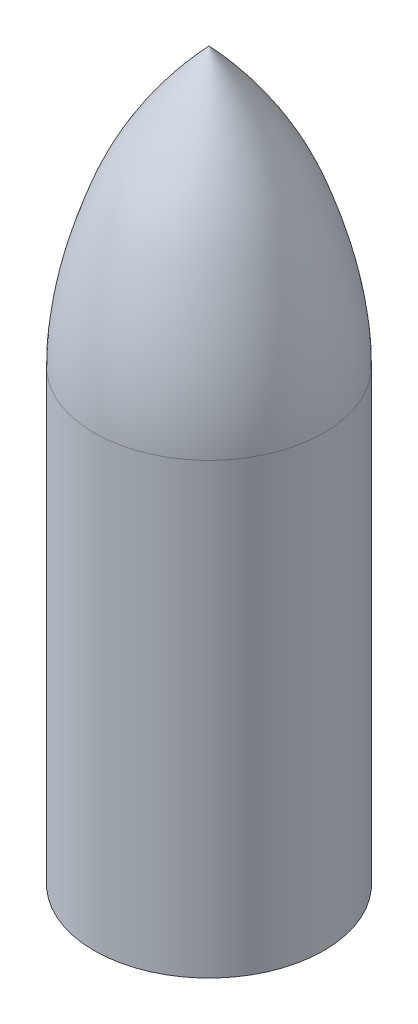
ISO-10303-21;
HEADER;
FILE_DESCRIPTION(('STEP AP214'),'2;1');
FILE_NAME('part.step','',(''),(''),'','','');
FILE_SCHEMA(('AUTOMOTIVE_DESIGN { 1 0 10303 214 1 1 1 1 }'));
ENDSEC;
DATA;
#1=APPLICATION_CONTEXT('core data for automotive mechanical design processes');
#2=APPLICATION_PROTOCOL_DEFINITION('international standard','automotive_design',2000,#1);
#3=PRODUCT_CONTEXT('',#1,'mechanical');
#4=PRODUCT('Part','Part','',(#3));
#5=PRODUCT_RELATED_PRODUCT_CATEGORY('part','',(#4));
#6=PRODUCT_DEFINITION_FORMATION('','',#4);
#7=PRODUCT_DEFINITION_CONTEXT('part definition',#1,'design');
#8=PRODUCT_DEFINITION('design','',#6,#7);
#9=PRODUCT_DEFINITION_SHAPE('','',#8);
#10=(LENGTH_UNIT() NAMED_UNIT(*) SI_UNIT(.MILLI.,.METRE.));
#11=(NAMED_UNIT(*) PLANE_ANGLE_UNIT() SI_UNIT($,.RADIAN.));
#12=(NAMED_UNIT(*) SI_UNIT($,.STERADIAN.) SOLID_ANGLE_UNIT());
#13=UNCERTAINTY_MEASURE_WITH_UNIT(LENGTH_MEASURE(1.E-05),#10,'distance_accuracy_value','');
#14=(GEOMETRIC_REPRESENTATION_CONTEXT(3) GLOBAL_UNCERTAINTY_ASSIGNED_CONTEXT((#13)) GLOBAL_UNIT_ASSIGNED_CONTEXT((#10,
#11,#12)) REPRESENTATION_CONTEXT('',''));
#15=CARTESIAN_POINT('',(0.,0.,0.));
#16=DIRECTION('',(0.,0.,1.));
#17=DIRECTION('',(1.,0.,0.));
#18=AXIS2_PLACEMENT_3D('',#15,#16,#17);
#19=CARTESIAN_POINT('',(0.,-160.,9.17105263157896));
#20=DIRECTION('',(0.,0.,1.));
#21=DIRECTION('',(1.,0.,0.));
#22=AXIS2_PLACEMENT_3D('',#19,#20,#21);
#23=PLANE('',#22);
#24=DIRECTION('',(1.,0.,0.));
#25=VECTOR('',#24,1.);
#26=CARTESIAN_POINT('',(0.,0.,9.17105263157896));
#27=LINE('',#26,#25);
#28=CARTESIAN_POINT('',(-36.9739850146078,0.,9.17105263157896));
#29=VERTEX_POINT('',#28);
#30=CARTESIAN_POINT('',(-25.3947197981944,0.,9.17105263157896));
#31=VERTEX_POINT('',#30);
#32=EDGE_CURVE('E153',#29,#31,#27,.T.);
#33=ORIENTED_EDGE('',*,*,#32,.T.);
#34=DIRECTION('',(0.,1.,0.));
#35=VECTOR('',#34,1.);
#36=CARTESIAN_POINT('',(-25.3947197981944,-160.,9.17105263157896));
#37=LINE('',#36,#35);
#38=CARTESIAN_POINT('',(-25.3947197981944,-160.,9.17105263157896));
#39=VERTEX_POINT('',#38);
#40=EDGE_CURVE('E11',#39,#31,#37,.T.);
#41=ORIENTED_EDGE('',*,*,#40,.F.);
#42=DIRECTION('',(1.,0.,0.));
#43=VECTOR('',#42,1.);
#44=CARTESIAN_POINT('',(0.,-160.,9.17105263157896));
#45=LINE('',#44,#43);
#46=CARTESIAN_POINT('',(-36.9739850146078,-160.,9.17105263157896));
#47=VERTEX_POINT('',#46);
#48=EDGE_CURVE('E110',#47,#39,#45,.T.);
#49=ORIENTED_EDGE('',*,*,#48,.F.);
#50=DIRECTION('',(0.,1.,0.));
#51=VECTOR('',#50,1.);
#52=CARTESIAN_POINT('',(-36.9739850146078,-160.,9.17105263157896));
#53=LINE('',#52,#51);
#54=EDGE_CURVE('E41',#47,#29,#53,.T.);
#55=ORIENTED_EDGE('',*,*,#54,.T.);
#56=EDGE_LOOP('',(#33,#41,#49,#55));
#57=FACE_BOUND('',#56,.T.);
#58=ADVANCED_FACE('F37',(#57),#23,.F.);
#59=CARTESIAN_POINT('',(0.,-160.,0.));
#60=DIRECTION('',(0.,1.,0.));
#61=DIRECTION('',(0.,0.,1.));
#62=AXIS2_PLACEMENT_3D('',#59,#60,#61);
#63=CYLINDRICAL_SURFACE('',#62,27.);
#64=CARTESIAN_POINT('',(0.,0.,0.));
#65=DIRECTION('',(0.,1.,0.));
#66=DIRECTION('',(0.,0.,1.));
#67=AXIS2_PLACEMENT_3D('',#64,#65,#66);
#68=CIRCLE('',#67,27.);
#69=CARTESIAN_POINT('',(25.3947197981944,0.,9.17105263157896));
#70=VERTEX_POINT('',#69);
#71=EDGE_CURVE('E111',#31,#70,#68,.T.);
#72=ORIENTED_EDGE('',*,*,#71,.T.);
#73=DIRECTION('',(0.,1.,0.));
#74=VECTOR('',#73,1.);
#75=CARTESIAN_POINT('',(25.3947197981944,-160.,9.17105263157896));
#76=LINE('',#75,#74);
#77=CARTESIAN_POINT('',(25.3947197981944,-160.,9.17105263157896));
#78=VERTEX_POINT('',#77);
#79=EDGE_CURVE('E47',#78,#70,#76,.T.);
#80=ORIENTED_EDGE('',*,*,#79,.F.);
#81=CARTESIAN_POINT('',(0.,-160.,0.));
#82=DIRECTION('',(0.,1.,0.));
#83=DIRECTION('',(0.,0.,1.));
#84=AXIS2_PLACEMENT_3D('',#81,#82,#83);
#85=CIRCLE('',#84,27.);
#86=EDGE_CURVE('E54',#39,#78,#85,.T.);
#87=ORIENTED_EDGE('',*,*,#86,.F.);
#88=ORIENTED_EDGE('',*,*,#40,.T.);
#89=EDGE_LOOP('',(#72,#80,#87,#88));
#90=FACE_BOUND('',#89,.T.);
#91=ADVANCED_FACE('F182',(#90),#63,.F.);
#92=CARTESIAN_POINT('',(37.0260149853922,0.,9.17105263157896));
#93=VERTEX_POINT('',#92);
#94=EDGE_CURVE('E117',#70,#93,#27,.T.);
#95=ORIENTED_EDGE('',*,*,#94,.T.);
#96=DIRECTION('',(0.,1.,0.));
#97=VECTOR('',#96,1.);
#98=CARTESIAN_POINT('',(37.0260149853922,-160.,9.17105263157896));
#99=LINE('',#98,#97);
#100=CARTESIAN_POINT('',(37.0260149853922,-160.,9.17105263157896));
#101=VERTEX_POINT('',#100);
#102=EDGE_CURVE('E123',#101,#93,#99,.T.);
#103=ORIENTED_EDGE('',*,*,#102,.F.);
#104=EDGE_CURVE('E115',#78,#101,#45,.T.);
#105=ORIENTED_EDGE('',*,*,#104,.F.);
#106=ORIENTED_EDGE('',*,*,#79,.T.);
#107=EDGE_LOOP('',(#95,#103,#105,#106));
#108=FACE_BOUND('',#107,.T.);
#109=ADVANCED_FACE('F181',(#108),#23,.F.);
#110=CARTESIAN_POINT('',(37.0260149853922,-160.,0.));
#111=DIRECTION('',(-1.,0.,0.));
#112=DIRECTION('',(0.,0.,1.));
#113=AXIS2_PLACEMENT_3D('',#110,#111,#112);
#114=PLANE('',#113);
#115=DIRECTION('',(0.,0.,1.));
#116=VECTOR('',#115,1.);
#117=CARTESIAN_POINT('',(37.0260149853922,0.,0.));
#118=LINE('',#117,#116);
#119=CARTESIAN_POINT('',(37.0260149853922,0.,-9.17105263157896));
#120=VERTEX_POINT('',#119);
#121=EDGE_CURVE('E162',#120,#93,#118,.T.);
#122=ORIENTED_EDGE('',*,*,#121,.F.);
#123=DIRECTION('',(0.,1.,0.));
#124=VECTOR('',#123,1.);
#125=CARTESIAN_POINT('',(37.0260149853922,-160.,-9.17105263157896));
#126=LINE('',#125,#124);
#127=CARTESIAN_POINT('',(37.0260149853922,-160.,-9.17105263157896));
#128=VERTEX_POINT('',#127);
#129=EDGE_CURVE('E126',#128,#120,#126,.T.);
#130=ORIENTED_EDGE('',*,*,#129,.F.);
#131=DIRECTION('',(0.,0.,1.));
#132=VECTOR('',#131,1.);
#133=CARTESIAN_POINT('',(37.0260149853922,-160.,0.));
#134=LINE('',#133,#132);
#135=EDGE_CURVE('E178',#128,#101,#134,.T.);
#136=ORIENTED_EDGE('',*,*,#135,.T.);
#137=ORIENTED_EDGE('',*,*,#102,.T.);
#138=EDGE_LOOP('',(#122,#130,#136,#137));
#139=FACE_BOUND('',#138,.T.);
#140=ADVANCED_FACE('F176',(#139),#114,.T.);
#141=CARTESIAN_POINT('',(0.,-160.,-9.17105263157896));
#142=DIRECTION('',(0.,0.,1.));
#143=DIRECTION('',(1.,0.,0.));
#144=AXIS2_PLACEMENT_3D('',#141,#142,#143);
#145=PLANE('',#144);
#146=DIRECTION('',(1.,0.,0.));
#147=VECTOR('',#146,1.);
#148=CARTESIAN_POINT('',(0.,0.,-9.17105263157896));
#149=LINE('',#148,#147);
#150=CARTESIAN_POINT('',(25.3947197981944,0.,-9.17105263157896));
#151=VERTEX_POINT('',#150);
#152=EDGE_CURVE('E160',#151,#120,#149,.T.);
#153=ORIENTED_EDGE('',*,*,#152,.F.);
#154=DIRECTION('',(0.,1.,0.));
#155=VECTOR('',#154,1.);
#156=CARTESIAN_POINT('',(25.3947197981944,-160.,-9.17105263157896));
#157=LINE('',#156,#155);
#158=CARTESIAN_POINT('',(25.3947197981944,-160.,-9.17105263157896));
#159=VERTEX_POINT('',#158);
#160=EDGE_CURVE('E129',#159,#151,#157,.T.);
#161=ORIENTED_EDGE('',*,*,#160,.F.);
#162=DIRECTION('',(1.,0.,0.));
#163=VECTOR('',#162,1.);
#164=CARTESIAN_POINT('',(0.,-160.,-9.17105263157896));
#165=LINE('',#164,#163);
#166=EDGE_CURVE('E172',#159,#128,#165,.T.);
#167=ORIENTED_EDGE('',*,*,#166,.T.);
#168=ORIENTED_EDGE('',*,*,#129,.T.);
#169=EDGE_LOOP('',(#153,#161,#167,#168));
#170=FACE_BOUND('',#169,.T.);
#171=ADVANCED_FACE('F170',(#170),#145,.T.);
#172=CARTESIAN_POINT('',(0.,-160.,0.));
#173=DIRECTION('',(0.,1.,0.));
#174=DIRECTION('',(0.,0.,1.));
#175=AXIS2_PLACEMENT_3D('',#172,#173,#174);
#176=CYLINDRICAL_SURFACE('',#175,27.);
#177=CARTESIAN_POINT('',(0.,0.,0.));
#178=DIRECTION('',(0.,1.,0.));
#179=DIRECTION('',(0.,0.,1.));
#180=AXIS2_PLACEMENT_3D('',#177,#178,#179);
#181=CIRCLE('',#180,27.);
#182=CARTESIAN_POINT('',(-25.3947197981944,0.,-9.17105263157896));
#183=VERTEX_POINT('',#182);
#184=EDGE_CURVE('E159',#151,#183,#181,.T.);
#185=ORIENTED_EDGE('',*,*,#184,.T.);
#186=DIRECTION('',(0.,1.,0.));
#187=VECTOR('',#186,1.);
#188=CARTESIAN_POINT('',(-25.3947197981944,-160.,-9.17105263157896));
#189=LINE('',#188,#187);
#190=CARTESIAN_POINT('',(-25.3947197981944,-160.,-9.17105263157896));
#191=VERTEX_POINT('',#190);
#192=EDGE_CURVE('E132',#191,#183,#189,.T.);
#193=ORIENTED_EDGE('',*,*,#192,.F.);
#194=CARTESIAN_POINT('',(0.,-160.,0.));
#195=DIRECTION('',(0.,1.,0.));
#196=DIRECTION('',(0.,0.,1.));
#197=AXIS2_PLACEMENT_3D('',#194,#195,#196);
#198=CIRCLE('',#197,27.);
#199=EDGE_CURVE('E190',#159,#191,#198,.T.);
#200=ORIENTED_EDGE('',*,*,#199,.F.);
#201=ORIENTED_EDGE('',*,*,#160,.T.);
#202=EDGE_LOOP('',(#185,#193,#200,#201));
#203=FACE_BOUND('',#202,.T.);
#204=ADVANCED_FACE('F197',(#203),#176,.F.);
#205=CARTESIAN_POINT('',(-36.9739850146078,0.,-9.17105263157896));
#206=VERTEX_POINT('',#205);
#207=EDGE_CURVE('E157',#206,#183,#149,.T.);
#208=ORIENTED_EDGE('',*,*,#207,.F.);
#209=DIRECTION('',(0.,1.,0.));
#210=VECTOR('',#209,1.);
#211=CARTESIAN_POINT('',(-36.9739850146078,-160.,-9.17105263157896));
#212=LINE('',#211,#210);
#213=CARTESIAN_POINT('',(-36.9739850146078,-160.,-9.17105263157896));
#214=VERTEX_POINT('',#213);
#215=EDGE_CURVE('E134',#214,#206,#212,.T.);
#216=ORIENTED_EDGE('',*,*,#215,.F.);
#217=EDGE_CURVE('E188',#214,#191,#165,.T.);
#218=ORIENTED_EDGE('',*,*,#217,.T.);
#219=ORIENTED_EDGE('',*,*,#192,.T.);
#220=EDGE_LOOP('',(#208,#216,#218,#219));
#221=FACE_BOUND('',#220,.T.);
#222=ADVANCED_FACE('F199',(#221),#145,.T.);
#223=CARTESIAN_POINT('',(-36.9739850146078,-160.,0.));
#224=DIRECTION('',(-1.,0.,0.));
#225=DIRECTION('',(0.,0.,1.));
#226=AXIS2_PLACEMENT_3D('',#223,#224,#225);
#227=PLANE('',#226);
#228=DIRECTION('',(0.,0.,1.));
#229=VECTOR('',#228,1.);
#230=CARTESIAN_POINT('',(-36.9739850146078,0.,0.));
#231=LINE('',#230,#229);
#232=EDGE_CURVE('E155',#206,#29,#231,.T.);
#233=ORIENTED_EDGE('',*,*,#232,.T.);
#234=ORIENTED_EDGE('',*,*,#54,.F.);
#235=DIRECTION('',(0.,0.,1.));
#236=VECTOR('',#235,1.);
#237=CARTESIAN_POINT('',(-36.9739850146078,-160.,0.));
#238=LINE('',#237,#236);
#239=EDGE_CURVE('E113',#214,#47,#238,.T.);
#240=ORIENTED_EDGE('',*,*,#239,.F.);
#241=ORIENTED_EDGE('',*,*,#215,.T.);
#242=EDGE_LOOP('',(#233,#234,#240,#241));
#243=FACE_BOUND('',#242,.T.);
#244=ADVANCED_FACE('F39',(#243),#227,.F.);
#245=CARTESIAN_POINT('',(0.,-160.,0.));
#246=DIRECTION('',(0.,1.,0.));
#247=DIRECTION('',(0.,0.,1.));
#248=AXIS2_PLACEMENT_3D('',#245,#246,#247);
#249=CYLINDRICAL_SURFACE('',#248,41.);
#250=CARTESIAN_POINT('',(0.,-160.,0.));
#251=DIRECTION('',(0.,1.,0.));
#252=DIRECTION('',(0.,0.,1.));
#253=AXIS2_PLACEMENT_3D('',#250,#251,#252);
#254=CIRCLE('',#253,41.);
#255=CARTESIAN_POINT('',(0.,-160.,41.));
#256=VERTEX_POINT('',#255);
#257=EDGE_CURVE('E141',#256,#256,#254,.T.);
#258=ORIENTED_EDGE('',*,*,#257,.T.);
#259=EDGE_LOOP('',(#258));
#260=FACE_BOUND('',#259,.T.);
#261=CARTESIAN_POINT('',(0.,0.,0.));
#262=DIRECTION('',(0.,1.,0.));
#263=DIRECTION('',(0.,0.,1.));
#264=AXIS2_PLACEMENT_3D('',#261,#262,#263);
#265=CIRCLE('',#264,41.);
#266=CARTESIAN_POINT('',(0.,0.,41.));
#267=VERTEX_POINT('',#266);
#268=EDGE_CURVE('E108',#267,#267,#265,.T.);
#269=ORIENTED_EDGE('',*,*,#268,.F.);
#270=EDGE_LOOP('',(#269));
#271=FACE_BOUND('',#270,.T.);
#272=ADVANCED_FACE('F206',(#260,#271),#249,.T.);
#273=CARTESIAN_POINT('',(0.,-160.,0.));
#274=DIRECTION('',(0.,1.,0.));
#275=DIRECTION('',(0.,0.,1.));
#276=AXIS2_PLACEMENT_3D('',#273,#274,#275);
#277=PLANE('',#276);
#278=ORIENTED_EDGE('',*,*,#48,.T.);
#279=ORIENTED_EDGE('',*,*,#86,.T.);
#280=ORIENTED_EDGE('',*,*,#104,.T.);
#281=ORIENTED_EDGE('',*,*,#135,.F.);
#282=ORIENTED_EDGE('',*,*,#166,.F.);
#283=ORIENTED_EDGE('',*,*,#199,.T.);
#284=ORIENTED_EDGE('',*,*,#217,.F.);
#285=ORIENTED_EDGE('',*,*,#239,.T.);
#286=EDGE_LOOP('',(#278,#279,#280,#281,#282,#283,#284,#285));
#287=FACE_BOUND('',#286,.T.);
#288=ORIENTED_EDGE('',*,*,#257,.F.);
#289=EDGE_LOOP('',(#288));
#290=FACE_BOUND('',#289,.T.);
#291=ADVANCED_FACE('F104',(#287,#290),#277,.F.);
#292=CARTESIAN_POINT('',(41.,0.,0.));
#293=CARTESIAN_POINT('',(40.9692268046888,16.5594288136491,0.));
#294=CARTESIAN_POINT('',(36.3880825293176,36.3296254324283,0.));
#295=CARTESIAN_POINT('',(23.647174069344,70.3282060090938,0.));
#296=CARTESIAN_POINT('',(11.435717321584,87.0360461573528,0.));
#297=CARTESIAN_POINT('',(0.,99.0646234648734,0.));
#298=B_SPLINE_CURVE_WITH_KNOTS('',3,(#292,#293,#294,#295,#296,#297),.UNSPECIFIED.,.F.,.F.,(4,1,
1,4),(0.,0.452462301907218,0.541494573939955,1.),.UNSPECIFIED.);
#299=CARTESIAN_POINT('',(0.,0.,0.));
#300=DIRECTION('',(0.,-1.,0.));
#301=AXIS1_PLACEMENT('',#299,#300);
#302=SURFACE_OF_REVOLUTION('',#298,#301);
#303=CARTESIAN_POINT('',(0.,99.0646234648734,0.));
#304=VERTEX_POINT('',#303);
#305=VERTEX_LOOP('',#304);
#306=FACE_BOUND('',#305,.T.);
#307=ORIENTED_EDGE('',*,*,#268,.T.);
#308=EDGE_LOOP('',(#307));
#309=FACE_BOUND('',#308,.T.);
#310=ADVANCED_FACE('F100',(#306,#309),#302,.F.);
#311=CARTESIAN_POINT('',(41.,0.,0.));
#312=DIRECTION('',(0.,-1.,0.));
#313=DIRECTION('',(0.,0.,-1.));
#314=AXIS2_PLACEMENT_3D('',#311,#312,#313);
#315=PLANE('',#314);
#316=ORIENTED_EDGE('',*,*,#32,.F.);
#317=ORIENTED_EDGE('',*,*,#232,.F.);
#318=ORIENTED_EDGE('',*,*,#207,.T.);
#319=ORIENTED_EDGE('',*,*,#184,.F.);
#320=ORIENTED_EDGE('',*,*,#152,.T.);
#321=ORIENTED_EDGE('',*,*,#121,.T.);
#322=ORIENTED_EDGE('',*,*,#94,.F.);
#323=ORIENTED_EDGE('',*,*,#71,.F.);
#324=EDGE_LOOP('',(#316,#317,#318,#319,#320,#321,#322,#323));
#325=FACE_BOUND('',#324,.T.);
#326=ADVANCED_FACE('F103',(#325),#315,.T.);
#327=CLOSED_SHELL('',(#58,#91,#109,#140,#171,#204,#222,#244,#272,#291,#310,#326));
#328=MANIFOLD_SOLID_BREP('B2',#327);
#329=ADVANCED_BREP_SHAPE_REPRESENTATION('',(#18,#328),#14);
#330=SHAPE_DEFINITION_REPRESENTATION(#9,#329);
ENDSEC;
END-ISO-10303-21;
